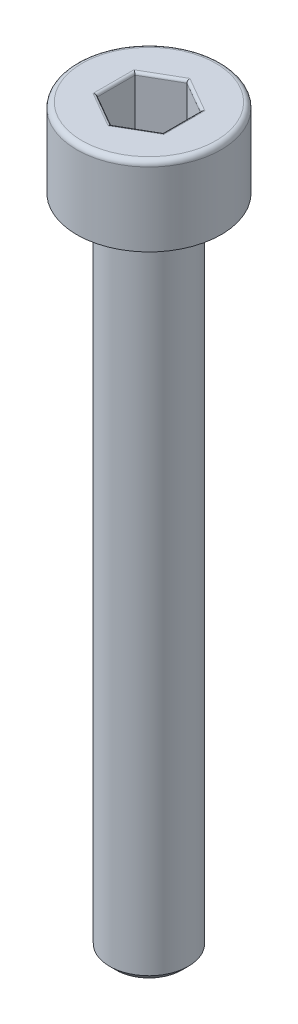
ISO-10303-21;
HEADER;
FILE_DESCRIPTION(('STEP AP214'),'2;1');
FILE_NAME('part.step','',(''),(''),'','','');
FILE_SCHEMA(('AUTOMOTIVE_DESIGN { 1 0 10303 214 1 1 1 1 }'));
ENDSEC;
DATA;
#1=APPLICATION_CONTEXT('core data for automotive mechanical design processes');
#2=APPLICATION_PROTOCOL_DEFINITION('international standard','automotive_design',2000,#1);
#3=PRODUCT_CONTEXT('',#1,'mechanical');
#4=PRODUCT('Part','Part','',(#3));
#5=PRODUCT_RELATED_PRODUCT_CATEGORY('part','',(#4));
#6=PRODUCT_DEFINITION_FORMATION('','',#4);
#7=PRODUCT_DEFINITION_CONTEXT('part definition',#1,'design');
#8=PRODUCT_DEFINITION('design','',#6,#7);
#9=PRODUCT_DEFINITION_SHAPE('','',#8);
#10=(LENGTH_UNIT() NAMED_UNIT(*) SI_UNIT(.MILLI.,.METRE.));
#11=(NAMED_UNIT(*) PLANE_ANGLE_UNIT() SI_UNIT($,.RADIAN.));
#12=(NAMED_UNIT(*) SI_UNIT($,.STERADIAN.) SOLID_ANGLE_UNIT());
#13=UNCERTAINTY_MEASURE_WITH_UNIT(LENGTH_MEASURE(1.E-05),#10,'distance_accuracy_value','');
#14=(GEOMETRIC_REPRESENTATION_CONTEXT(3) GLOBAL_UNCERTAINTY_ASSIGNED_CONTEXT((#13)) GLOBAL_UNIT_ASSIGNED_CONTEXT((#10,
#11,#12)) REPRESENTATION_CONTEXT('',''));
#15=CARTESIAN_POINT('',(0.,0.,0.));
#16=DIRECTION('',(0.,0.,1.));
#17=DIRECTION('',(1.,0.,0.));
#18=AXIS2_PLACEMENT_3D('',#15,#16,#17);
#19=CARTESIAN_POINT('',(0.,-28.,0.));
#20=DIRECTION('',(0.,-1.,0.));
#21=DIRECTION('',(0.,0.,-1.));
#22=AXIS2_PLACEMENT_3D('',#19,#20,#21);
#23=PLANE('',#22);
#24=CARTESIAN_POINT('',(0.,-28.,0.));
#25=DIRECTION('',(0.,-1.,0.));
#26=DIRECTION('',(0.,0.,-1.));
#27=AXIS2_PLACEMENT_3D('',#24,#25,#26);
#28=CIRCLE('',#27,1.25);
#29=CARTESIAN_POINT('',(0.,-28.,-1.25));
#30=VERTEX_POINT('',#29);
#31=EDGE_CURVE('E263',#30,#30,#28,.T.);
#32=ORIENTED_EDGE('',*,*,#31,.T.);
#33=EDGE_LOOP('',(#32));
#34=FACE_BOUND('',#33,.T.);
#35=ADVANCED_FACE('F35',(#34),#23,.T.);
#36=CARTESIAN_POINT('',(0.,0.,0.));
#37=DIRECTION('',(0.,1.,0.));
#38=DIRECTION('',(0.,0.,1.));
#39=AXIS2_PLACEMENT_3D('',#36,#37,#38);
#40=CYLINDRICAL_SURFACE('',#39,1.5);
#41=CARTESIAN_POINT('',(0.,-3.25,0.));
#42=DIRECTION('',(0.,-1.,0.));
#43=DIRECTION('',(0.,0.,-1.));
#44=AXIS2_PLACEMENT_3D('',#41,#42,#43);
#45=CIRCLE('',#44,1.5);
#46=CARTESIAN_POINT('',(0.,-3.25,-1.5));
#47=VERTEX_POINT('',#46);
#48=EDGE_CURVE('E260',#47,#47,#45,.T.);
#49=ORIENTED_EDGE('',*,*,#48,.T.);
#50=EDGE_LOOP('',(#49));
#51=FACE_BOUND('',#50,.T.);
#52=CARTESIAN_POINT('',(0.,-27.75,0.));
#53=DIRECTION('',(0.,-1.,0.));
#54=DIRECTION('',(0.,0.,-1.));
#55=AXIS2_PLACEMENT_3D('',#52,#53,#54);
#56=CIRCLE('',#55,1.5);
#57=CARTESIAN_POINT('',(0.,-27.75,-1.5));
#58=VERTEX_POINT('',#57);
#59=EDGE_CURVE('E257',#58,#58,#56,.F.);
#60=ORIENTED_EDGE('',*,*,#59,.T.);
#61=EDGE_LOOP('',(#60));
#62=FACE_BOUND('',#61,.T.);
#63=ADVANCED_FACE('F289',(#51,#62),#40,.T.);
#64=CARTESIAN_POINT('',(-1.5,-3.,0.));
#65=DIRECTION('',(0.,-1.,0.));
#66=DIRECTION('',(0.,0.,-1.));
#67=AXIS2_PLACEMENT_3D('',#64,#65,#66);
#68=PLANE('',#67);
#69=CARTESIAN_POINT('',(0.,-3.,0.));
#70=DIRECTION('',(0.,-1.,0.));
#71=DIRECTION('',(0.,0.,-1.));
#72=AXIS2_PLACEMENT_3D('',#69,#70,#71);
#73=CIRCLE('',#72,1.75);
#74=CARTESIAN_POINT('',(0.,-3.,-1.75));
#75=VERTEX_POINT('',#74);
#76=EDGE_CURVE('E254',#75,#75,#73,.F.);
#77=ORIENTED_EDGE('',*,*,#76,.T.);
#78=EDGE_LOOP('',(#77));
#79=FACE_BOUND('',#78,.T.);
#80=CARTESIAN_POINT('',(0.,-3.,0.));
#81=DIRECTION('',(0.,1.,0.));
#82=DIRECTION('',(0.,0.,1.));
#83=AXIS2_PLACEMENT_3D('',#80,#81,#82);
#84=CIRCLE('',#83,2.75);
#85=CARTESIAN_POINT('',(0.,-3.,2.75));
#86=VERTEX_POINT('',#85);
#87=EDGE_CURVE('E251',#86,#86,#84,.T.);
#88=ORIENTED_EDGE('',*,*,#87,.F.);
#89=EDGE_LOOP('',(#88));
#90=FACE_BOUND('',#89,.T.);
#91=ADVANCED_FACE('F295',(#79,#90),#68,.T.);
#92=CARTESIAN_POINT('',(0.,0.,0.));
#93=DIRECTION('',(0.,1.,0.));
#94=DIRECTION('',(0.,0.,1.));
#95=AXIS2_PLACEMENT_3D('',#92,#93,#94);
#96=CYLINDRICAL_SURFACE('',#95,2.75);
#97=CARTESIAN_POINT('',(0.,-0.2,0.));
#98=DIRECTION('',(0.,1.,0.));
#99=DIRECTION('',(0.,0.,1.));
#100=AXIS2_PLACEMENT_3D('',#97,#98,#99);
#101=CIRCLE('',#100,2.75);
#102=CARTESIAN_POINT('',(0.,-0.2,2.75));
#103=VERTEX_POINT('',#102);
#104=EDGE_CURVE('E161',#103,#103,#101,.F.);
#105=ORIENTED_EDGE('',*,*,#104,.T.);
#106=EDGE_LOOP('',(#105));
#107=FACE_BOUND('',#106,.T.);
#108=ORIENTED_EDGE('',*,*,#87,.T.);
#109=EDGE_LOOP('',(#108));
#110=FACE_BOUND('',#109,.T.);
#111=ADVANCED_FACE('F305',(#107,#110),#96,.T.);
#112=CARTESIAN_POINT('',(-2.75,0.,0.));
#113=DIRECTION('',(0.,1.,0.));
#114=DIRECTION('',(0.,0.,1.));
#115=AXIS2_PLACEMENT_3D('',#112,#113,#114);
#116=PLANE('',#115);
#117=DIRECTION('',(0.,0.,1.));
#118=VECTOR('',#117,1.);
#119=CARTESIAN_POINT('',(-1.35,0.,-0.721687836487033));
#120=LINE('',#119,#118);
#121=CARTESIAN_POINT('',(-1.35,0.,0.779422863405995));
#122=VERTEX_POINT('',#121);
#123=CARTESIAN_POINT('',(-1.35,0.,-0.779422863405995));
#124=VERTEX_POINT('',#123);
#125=EDGE_CURVE('E177',#122,#124,#120,.F.);
#126=ORIENTED_EDGE('',*,*,#125,.T.);
#127=DIRECTION('',(-0.866025403784439,0.,0.5));
#128=VECTOR('',#127,1.);
#129=CARTESIAN_POINT('',(-0.0500000000000002,0.,-1.52997821335251));
#130=LINE('',#129,#128);
#131=CARTESIAN_POINT('',(0.,0.,-1.55884572681199));
#132=VERTEX_POINT('',#131);
#133=EDGE_CURVE('E136',#124,#132,#130,.F.);
#134=ORIENTED_EDGE('',*,*,#133,.T.);
#135=DIRECTION('',(-0.866025403784439,0.,-0.5));
#136=VECTOR('',#135,1.);
#137=CARTESIAN_POINT('',(1.3,0.,-0.808290376865477));
#138=LINE('',#137,#136);
#139=CARTESIAN_POINT('',(1.35,0.,-0.779422863405995));
#140=VERTEX_POINT('',#139);
#141=EDGE_CURVE('E163',#132,#140,#138,.F.);
#142=ORIENTED_EDGE('',*,*,#141,.T.);
#143=DIRECTION('',(0.,0.,-1.));
#144=VECTOR('',#143,1.);
#145=CARTESIAN_POINT('',(1.35,0.,0.721687836487034));
#146=LINE('',#145,#144);
#147=CARTESIAN_POINT('',(1.35,0.,0.779422863405996));
#148=VERTEX_POINT('',#147);
#149=EDGE_CURVE('E171',#140,#148,#146,.F.);
#150=ORIENTED_EDGE('',*,*,#149,.T.);
#151=DIRECTION('',(0.866025403784439,0.,-0.5));
#152=VECTOR('',#151,1.);
#153=CARTESIAN_POINT('',(0.05,0.,1.52997821335251));
#154=LINE('',#153,#152);
#155=CARTESIAN_POINT('',(0.,0.,1.55884572681199));
#156=VERTEX_POINT('',#155);
#157=EDGE_CURVE('E173',#148,#156,#154,.F.);
#158=ORIENTED_EDGE('',*,*,#157,.T.);
#159=DIRECTION('',(0.866025403784438,0.,0.5));
#160=VECTOR('',#159,1.);
#161=CARTESIAN_POINT('',(-1.3,0.,0.808290376865476));
#162=LINE('',#161,#160);
#163=EDGE_CURVE('E175',#156,#122,#162,.F.);
#164=ORIENTED_EDGE('',*,*,#163,.T.);
#165=EDGE_LOOP('',(#126,#134,#142,#150,#158,#164));
#166=FACE_BOUND('',#165,.T.);
#167=CARTESIAN_POINT('',(0.,0.,0.));
#168=DIRECTION('',(0.,1.,0.));
#169=DIRECTION('',(0.,0.,1.));
#170=AXIS2_PLACEMENT_3D('',#167,#168,#169);
#171=CIRCLE('',#170,2.55);
#172=CARTESIAN_POINT('',(0.,0.,2.55));
#173=VERTEX_POINT('',#172);
#174=EDGE_CURVE('E166',#173,#173,#171,.T.);
#175=ORIENTED_EDGE('',*,*,#174,.T.);
#176=EDGE_LOOP('',(#175));
#177=FACE_BOUND('',#176,.T.);
#178=ADVANCED_FACE('F268',(#166,#177),#116,.T.);
#179=CARTESIAN_POINT('',(0.,-3.,0.));
#180=DIRECTION('',(0.,1.,0.));
#181=DIRECTION('',(0.,0.,1.));
#182=AXIS2_PLACEMENT_3D('',#179,#180,#181);
#183=CONICAL_SURFACE('',#182,1.75,0.785398163397452);
#184=ORIENTED_EDGE('',*,*,#48,.F.);
#185=EDGE_LOOP('',(#184));
#186=FACE_BOUND('',#185,.T.);
#187=ORIENTED_EDGE('',*,*,#76,.F.);
#188=EDGE_LOOP('',(#187));
#189=FACE_BOUND('',#188,.T.);
#190=ADVANCED_FACE('F283',(#186,#189),#183,.T.);
#191=CARTESIAN_POINT('',(0.,-27.75,0.));
#192=DIRECTION('',(0.,1.,0.));
#193=DIRECTION('',(0.,0.,1.));
#194=AXIS2_PLACEMENT_3D('',#191,#192,#193);
#195=CONICAL_SURFACE('',#194,1.5,0.785398163397451);
#196=ORIENTED_EDGE('',*,*,#31,.F.);
#197=EDGE_LOOP('',(#196));
#198=FACE_BOUND('',#197,.T.);
#199=ORIENTED_EDGE('',*,*,#59,.F.);
#200=EDGE_LOOP('',(#199));
#201=FACE_BOUND('',#200,.T.);
#202=ADVANCED_FACE('F273',(#198,#201),#195,.T.);
#203=CARTESIAN_POINT('',(0.,-0.2,0.));
#204=DIRECTION('',(0.,1.,0.));
#205=DIRECTION('',(0.,0.,1.));
#206=AXIS2_PLACEMENT_3D('',#203,#204,#205);
#207=TOROIDAL_SURFACE('',#206,2.55,0.2);
#208=ORIENTED_EDGE('',*,*,#104,.F.);
#209=EDGE_LOOP('',(#208));
#210=FACE_BOUND('',#209,.T.);
#211=ORIENTED_EDGE('',*,*,#174,.F.);
#212=EDGE_LOOP('',(#211));
#213=FACE_BOUND('',#212,.T.);
#214=ADVANCED_FACE('F270',(#210,#213),#207,.T.);
#215=CARTESIAN_POINT('',(1.25,-2.,-0.721687836487033));
#216=DIRECTION('',(0.5,0.,-0.866025403784439));
#217=DIRECTION('',(-0.866025403784439,0.,-0.5));
#218=AXIS2_PLACEMENT_3D('',#215,#216,#217);
#219=PLANE('',#218);
#220=DIRECTION('',(0.,1.,0.));
#221=VECTOR('',#220,1.);
#222=CARTESIAN_POINT('',(1.25,-2.,-0.721687836487033));
#223=LINE('',#222,#221);
#224=CARTESIAN_POINT('',(1.25,-1.9,-0.721687836487033));
#225=VERTEX_POINT('',#224);
#226=CARTESIAN_POINT('',(1.25,-0.1,-0.721687836487033));
#227=VERTEX_POINT('',#226);
#228=EDGE_CURVE('E245',#225,#227,#223,.T.);
#229=ORIENTED_EDGE('',*,*,#228,.T.);
#230=DIRECTION('',(-0.866025403784439,0.,-0.5));
#231=VECTOR('',#230,1.);
#232=CARTESIAN_POINT('',(0.,-0.1,-1.44337567297406));
#233=LINE('',#232,#231);
#234=CARTESIAN_POINT('',(0.,-0.1,-1.44337567297406));
#235=VERTEX_POINT('',#234);
#236=EDGE_CURVE('E197',#227,#235,#233,.T.);
#237=ORIENTED_EDGE('',*,*,#236,.T.);
#238=DIRECTION('',(0.,1.,0.));
#239=VECTOR('',#238,1.);
#240=CARTESIAN_POINT('',(0.,-2.,-1.44337567297406));
#241=LINE('',#240,#239);
#242=CARTESIAN_POINT('',(0.,-1.9,-1.44337567297406));
#243=VERTEX_POINT('',#242);
#244=EDGE_CURVE('E147',#243,#235,#241,.T.);
#245=ORIENTED_EDGE('',*,*,#244,.F.);
#246=DIRECTION('',(-0.866025403784439,0.,-0.5));
#247=VECTOR('',#246,1.);
#248=CARTESIAN_POINT('',(1.25,-1.9,-0.721687836487033));
#249=LINE('',#248,#247);
#250=EDGE_CURVE('E195',#243,#225,#249,.F.);
#251=ORIENTED_EDGE('',*,*,#250,.T.);
#252=EDGE_LOOP('',(#229,#237,#245,#251));
#253=FACE_BOUND('',#252,.T.);
#254=ADVANCED_FACE('F272',(#253),#219,.F.);
#255=CARTESIAN_POINT('',(1.25,-2.,0.721687836487034));
#256=DIRECTION('',(1.,0.,0.));
#257=DIRECTION('',(0.,0.,-1.));
#258=AXIS2_PLACEMENT_3D('',#255,#256,#257);
#259=PLANE('',#258);
#260=DIRECTION('',(0.,1.,0.));
#261=VECTOR('',#260,1.);
#262=CARTESIAN_POINT('',(1.25,-2.,0.721687836487034));
#263=LINE('',#262,#261);
#264=CARTESIAN_POINT('',(1.25,-1.9,0.721687836487034));
#265=VERTEX_POINT('',#264);
#266=CARTESIAN_POINT('',(1.25,-0.1,0.721687836487034));
#267=VERTEX_POINT('',#266);
#268=EDGE_CURVE('E242',#265,#267,#263,.T.);
#269=ORIENTED_EDGE('',*,*,#268,.T.);
#270=DIRECTION('',(0.,0.,-1.));
#271=VECTOR('',#270,1.);
#272=CARTESIAN_POINT('',(1.25,-0.1,-0.721687836487033));
#273=LINE('',#272,#271);
#274=EDGE_CURVE('E193',#267,#227,#273,.T.);
#275=ORIENTED_EDGE('',*,*,#274,.T.);
#276=ORIENTED_EDGE('',*,*,#228,.F.);
#277=DIRECTION('',(0.,0.,-1.));
#278=VECTOR('',#277,1.);
#279=CARTESIAN_POINT('',(1.25,-1.9,0.721687836487034));
#280=LINE('',#279,#278);
#281=EDGE_CURVE('E190',#225,#265,#280,.F.);
#282=ORIENTED_EDGE('',*,*,#281,.T.);
#283=EDGE_LOOP('',(#269,#275,#276,#282));
#284=FACE_BOUND('',#283,.T.);
#285=ADVANCED_FACE('F280',(#284),#259,.F.);
#286=CARTESIAN_POINT('',(0.,-2.,1.44337567297407));
#287=DIRECTION('',(0.5,0.,0.866025403784439));
#288=DIRECTION('',(0.866025403784439,0.,-0.5));
#289=AXIS2_PLACEMENT_3D('',#286,#287,#288);
#290=PLANE('',#289);
#291=DIRECTION('',(0.,1.,0.));
#292=VECTOR('',#291,1.);
#293=CARTESIAN_POINT('',(0.,-2.,1.44337567297407));
#294=LINE('',#293,#292);
#295=CARTESIAN_POINT('',(0.,-1.9,1.44337567297407));
#296=VERTEX_POINT('',#295);
#297=CARTESIAN_POINT('',(0.,-0.1,1.44337567297407));
#298=VERTEX_POINT('',#297);
#299=EDGE_CURVE('E239',#296,#298,#294,.T.);
#300=ORIENTED_EDGE('',*,*,#299,.T.);
#301=DIRECTION('',(0.866025403784439,0.,-0.5));
#302=VECTOR('',#301,1.);
#303=CARTESIAN_POINT('',(1.25,-0.1,0.721687836487034));
#304=LINE('',#303,#302);
#305=EDGE_CURVE('E188',#298,#267,#304,.T.);
#306=ORIENTED_EDGE('',*,*,#305,.T.);
#307=ORIENTED_EDGE('',*,*,#268,.F.);
#308=DIRECTION('',(0.866025403784439,0.,-0.5));
#309=VECTOR('',#308,1.);
#310=CARTESIAN_POINT('',(0.,-1.9,1.44337567297407));
#311=LINE('',#310,#309);
#312=EDGE_CURVE('E186',#265,#296,#311,.F.);
#313=ORIENTED_EDGE('',*,*,#312,.T.);
#314=EDGE_LOOP('',(#300,#306,#307,#313));
#315=FACE_BOUND('',#314,.T.);
#316=ADVANCED_FACE('F329',(#315),#290,.F.);
#317=CARTESIAN_POINT('',(-1.25,-2.,0.721687836487033));
#318=DIRECTION('',(-0.5,0.,0.866025403784439));
#319=DIRECTION('',(0.866025403784438,0.,0.5));
#320=AXIS2_PLACEMENT_3D('',#317,#318,#319);
#321=PLANE('',#320);
#322=DIRECTION('',(0.,1.,0.));
#323=VECTOR('',#322,1.);
#324=CARTESIAN_POINT('',(-1.25,-2.,0.721687836487033));
#325=LINE('',#324,#323);
#326=CARTESIAN_POINT('',(-1.25,-1.9,0.721687836487033));
#327=VERTEX_POINT('',#326);
#328=CARTESIAN_POINT('',(-1.25,-0.1,0.721687836487033));
#329=VERTEX_POINT('',#328);
#330=EDGE_CURVE('E130',#327,#329,#325,.T.);
#331=ORIENTED_EDGE('',*,*,#330,.T.);
#332=DIRECTION('',(0.866025403784438,0.,0.5));
#333=VECTOR('',#332,1.);
#334=CARTESIAN_POINT('',(0.,-0.1,1.44337567297407));
#335=LINE('',#334,#333);
#336=EDGE_CURVE('E184',#329,#298,#335,.T.);
#337=ORIENTED_EDGE('',*,*,#336,.T.);
#338=ORIENTED_EDGE('',*,*,#299,.F.);
#339=DIRECTION('',(0.866025403784438,0.,0.5));
#340=VECTOR('',#339,1.);
#341=CARTESIAN_POINT('',(-1.25,-1.9,0.721687836487033));
#342=LINE('',#341,#340);
#343=EDGE_CURVE('E182',#296,#327,#342,.F.);
#344=ORIENTED_EDGE('',*,*,#343,.T.);
#345=EDGE_LOOP('',(#331,#337,#338,#344));
#346=FACE_BOUND('',#345,.T.);
#347=ADVANCED_FACE('F236',(#346),#321,.F.);
#348=CARTESIAN_POINT('',(-1.25,-2.,-0.721687836487033));
#349=DIRECTION('',(-1.,0.,0.));
#350=DIRECTION('',(0.,0.,1.));
#351=AXIS2_PLACEMENT_3D('',#348,#349,#350);
#352=PLANE('',#351);
#353=DIRECTION('',(0.,1.,0.));
#354=VECTOR('',#353,1.);
#355=CARTESIAN_POINT('',(-1.25,-2.,-0.721687836487033));
#356=LINE('',#355,#354);
#357=CARTESIAN_POINT('',(-1.25,-1.9,-0.721687836487033));
#358=VERTEX_POINT('',#357);
#359=CARTESIAN_POINT('',(-1.25,-0.1,-0.721687836487033));
#360=VERTEX_POINT('',#359);
#361=EDGE_CURVE('E128',#358,#360,#356,.T.);
#362=ORIENTED_EDGE('',*,*,#361,.T.);
#363=DIRECTION('',(0.,0.,1.));
#364=VECTOR('',#363,1.);
#365=CARTESIAN_POINT('',(-1.25,-0.1,0.721687836487033));
#366=LINE('',#365,#364);
#367=EDGE_CURVE('E135',#360,#329,#366,.T.);
#368=ORIENTED_EDGE('',*,*,#367,.T.);
#369=ORIENTED_EDGE('',*,*,#330,.F.);
#370=DIRECTION('',(0.,0.,1.));
#371=VECTOR('',#370,1.);
#372=CARTESIAN_POINT('',(-1.25,-1.9,-0.721687836487033));
#373=LINE('',#372,#371);
#374=EDGE_CURVE('E125',#327,#358,#373,.F.);
#375=ORIENTED_EDGE('',*,*,#374,.T.);
#376=EDGE_LOOP('',(#362,#368,#369,#375));
#377=FACE_BOUND('',#376,.T.);
#378=ADVANCED_FACE('F127',(#377),#352,.F.);
#379=CARTESIAN_POINT('',(0.,-2.,-1.44337567297406));
#380=DIRECTION('',(-0.5,0.,-0.866025403784439));
#381=DIRECTION('',(-0.866025403784439,0.,0.5));
#382=AXIS2_PLACEMENT_3D('',#379,#380,#381);
#383=PLANE('',#382);
#384=ORIENTED_EDGE('',*,*,#244,.T.);
#385=DIRECTION('',(-0.866025403784439,0.,0.5));
#386=VECTOR('',#385,1.);
#387=CARTESIAN_POINT('',(-1.25,-0.1,-0.721687836487032));
#388=LINE('',#387,#386);
#389=EDGE_CURVE('E146',#235,#360,#388,.T.);
#390=ORIENTED_EDGE('',*,*,#389,.T.);
#391=ORIENTED_EDGE('',*,*,#361,.F.);
#392=DIRECTION('',(-0.866025403784439,0.,0.5));
#393=VECTOR('',#392,1.);
#394=CARTESIAN_POINT('',(0.,-1.9,-1.44337567297406));
#395=LINE('',#394,#393);
#396=EDGE_CURVE('E143',#358,#243,#395,.F.);
#397=ORIENTED_EDGE('',*,*,#396,.T.);
#398=EDGE_LOOP('',(#384,#390,#391,#397));
#399=FACE_BOUND('',#398,.T.);
#400=ADVANCED_FACE('F141',(#399),#383,.F.);
#401=CARTESIAN_POINT('',(1.25,-2.,-0.721687836487033));
#402=DIRECTION('',(0.,-1.,0.));
#403=DIRECTION('',(0.,0.,-1.));
#404=AXIS2_PLACEMENT_3D('',#401,#402,#403);
#405=PLANE('',#404);
#406=DIRECTION('',(0.866025403784439,0.,-0.5));
#407=VECTOR('',#406,1.);
#408=CARTESIAN_POINT('',(1.2,-2.,0.63508529610859));
#409=LINE('',#408,#407);
#410=CARTESIAN_POINT('',(0.,-2.,1.32790561913614));
#411=VERTEX_POINT('',#410);
#412=CARTESIAN_POINT('',(1.15,-2.,0.663952809568071));
#413=VERTEX_POINT('',#412);
#414=EDGE_CURVE('E44',#411,#413,#409,.T.);
#415=ORIENTED_EDGE('',*,*,#414,.T.);
#416=DIRECTION('',(0.,0.,-1.));
#417=VECTOR('',#416,1.);
#418=CARTESIAN_POINT('',(1.15,-2.,-0.721687836487033));
#419=LINE('',#418,#417);
#420=CARTESIAN_POINT('',(1.15,-2.,-0.66395280956807));
#421=VERTEX_POINT('',#420);
#422=EDGE_CURVE('E11',#413,#421,#419,.T.);
#423=ORIENTED_EDGE('',*,*,#422,.T.);
#424=DIRECTION('',(-0.866025403784439,0.,-0.5));
#425=VECTOR('',#424,1.);
#426=CARTESIAN_POINT('',(-0.0500000000000001,-2.,-1.35677313259562));
#427=LINE('',#426,#425);
#428=CARTESIAN_POINT('',(0.,-2.,-1.32790561913614));
#429=VERTEX_POINT('',#428);
#430=EDGE_CURVE('E199',#421,#429,#427,.T.);
#431=ORIENTED_EDGE('',*,*,#430,.T.);
#432=DIRECTION('',(-0.866025403784439,0.,0.5));
#433=VECTOR('',#432,1.);
#434=CARTESIAN_POINT('',(-1.2,-2.,-0.635085296108588));
#435=LINE('',#434,#433);
#436=CARTESIAN_POINT('',(-1.15,-2.,-0.66395280956807));
#437=VERTEX_POINT('',#436);
#438=EDGE_CURVE('E201',#429,#437,#435,.T.);
#439=ORIENTED_EDGE('',*,*,#438,.T.);
#440=DIRECTION('',(0.,0.,1.));
#441=VECTOR('',#440,1.);
#442=CARTESIAN_POINT('',(-1.15,-2.,0.721687836487033));
#443=LINE('',#442,#441);
#444=CARTESIAN_POINT('',(-1.15,-2.,0.66395280956807));
#445=VERTEX_POINT('',#444);
#446=EDGE_CURVE('E152',#437,#445,#443,.T.);
#447=ORIENTED_EDGE('',*,*,#446,.T.);
#448=DIRECTION('',(0.866025403784438,0.,0.5));
#449=VECTOR('',#448,1.);
#450=CARTESIAN_POINT('',(0.0499999999999999,-2.,1.35677313259562));
#451=LINE('',#450,#449);
#452=EDGE_CURVE('E55',#445,#411,#451,.T.);
#453=ORIENTED_EDGE('',*,*,#452,.T.);
#454=EDGE_LOOP('',(#415,#423,#431,#439,#447,#453));
#455=FACE_BOUND('',#454,.T.);
#456=ADVANCED_FACE('F324',(#455),#405,.F.);
#457=CARTESIAN_POINT('',(0.05,-0.1,1.52997821335251));
#458=DIRECTION('',(-0.866025403784439,0.,0.5));
#459=DIRECTION('',(0.5,0.,0.866025403784439));
#460=AXIS2_PLACEMENT_3D('',#457,#458,#459);
#461=CYLINDRICAL_SURFACE('',#460,0.1);
#462=CARTESIAN_POINT('',(0.,-0.1,1.55884572681199));
#463=DIRECTION('',(-1.,0.,0.));
#464=DIRECTION('',(0.,0.,-1.));
#465=AXIS2_PLACEMENT_3D('',#462,#463,#464);
#466=ELLIPSE('',#465,0.115470053837925,0.1);
#467=EDGE_CURVE('E216',#156,#298,#466,.T.);
#468=ORIENTED_EDGE('',*,*,#467,.F.);
#469=ORIENTED_EDGE('',*,*,#157,.F.);
#470=CARTESIAN_POINT('',(1.35,-0.1,0.779422863405997));
#471=DIRECTION('',(-0.5,0.,0.866025403784438));
#472=DIRECTION('',(-0.866025403784438,0.,-0.5));
#473=AXIS2_PLACEMENT_3D('',#470,#471,#472);
#474=ELLIPSE('',#473,0.115470053837925,0.1);
#475=EDGE_CURVE('E219',#267,#148,#474,.F.);
#476=ORIENTED_EDGE('',*,*,#475,.F.);
#477=ORIENTED_EDGE('',*,*,#305,.F.);
#478=EDGE_LOOP('',(#468,#469,#476,#477));
#479=FACE_BOUND('',#478,.T.);
#480=ADVANCED_FACE('F336',(#479),#461,.T.);
#481=CARTESIAN_POINT('',(1.35,-0.1,0.721687836487034));
#482=DIRECTION('',(0.,0.,1.));
#483=DIRECTION('',(1.,0.,0.));
#484=AXIS2_PLACEMENT_3D('',#481,#482,#483);
#485=CYLINDRICAL_SURFACE('',#484,0.1);
#486=ORIENTED_EDGE('',*,*,#475,.T.);
#487=ORIENTED_EDGE('',*,*,#149,.F.);
#488=CARTESIAN_POINT('',(1.35,-0.1,-0.779422863405995));
#489=DIRECTION('',(0.5,0.,0.866025403784439));
#490=DIRECTION('',(-0.866025403784439,0.,0.5));
#491=AXIS2_PLACEMENT_3D('',#488,#489,#490);
#492=ELLIPSE('',#491,0.115470053837925,0.1);
#493=EDGE_CURVE('E213',#227,#140,#492,.F.);
#494=ORIENTED_EDGE('',*,*,#493,.F.);
#495=ORIENTED_EDGE('',*,*,#274,.F.);
#496=EDGE_LOOP('',(#486,#487,#494,#495));
#497=FACE_BOUND('',#496,.T.);
#498=ADVANCED_FACE('F340',(#497),#485,.T.);
#499=CARTESIAN_POINT('',(-1.3,-0.1,0.808290376865476));
#500=DIRECTION('',(-0.866025403784438,0.,-0.5));
#501=DIRECTION('',(-0.5,0.,0.866025403784439));
#502=AXIS2_PLACEMENT_3D('',#499,#500,#501);
#503=CYLINDRICAL_SURFACE('',#502,0.1);
#504=ORIENTED_EDGE('',*,*,#467,.T.);
#505=ORIENTED_EDGE('',*,*,#336,.F.);
#506=CARTESIAN_POINT('',(-1.35,-0.1,0.779422863405995));
#507=DIRECTION('',(-0.5,0.,-0.866025403784439));
#508=DIRECTION('',(0.866025403784439,0.,-0.5));
#509=AXIS2_PLACEMENT_3D('',#506,#507,#508);
#510=ELLIPSE('',#509,0.115470053837925,0.1);
#511=EDGE_CURVE('E210',#122,#329,#510,.T.);
#512=ORIENTED_EDGE('',*,*,#511,.F.);
#513=ORIENTED_EDGE('',*,*,#163,.F.);
#514=EDGE_LOOP('',(#504,#505,#512,#513));
#515=FACE_BOUND('',#514,.T.);
#516=ADVANCED_FACE('F346',(#515),#503,.T.);
#517=CARTESIAN_POINT('',(1.3,-0.1,-0.808290376865477));
#518=DIRECTION('',(0.866025403784439,0.,0.5));
#519=DIRECTION('',(0.5,0.,-0.866025403784439));
#520=AXIS2_PLACEMENT_3D('',#517,#518,#519);
#521=CYLINDRICAL_SURFACE('',#520,0.1);
#522=ORIENTED_EDGE('',*,*,#493,.T.);
#523=ORIENTED_EDGE('',*,*,#141,.F.);
#524=CARTESIAN_POINT('',(0.,-0.1,-1.55884572681199));
#525=DIRECTION('',(1.,0.,0.));
#526=DIRECTION('',(0.,0.,-1.));
#527=AXIS2_PLACEMENT_3D('',#524,#525,#526);
#528=ELLIPSE('',#527,0.115470053837925,0.1);
#529=EDGE_CURVE('E208',#235,#132,#528,.F.);
#530=ORIENTED_EDGE('',*,*,#529,.F.);
#531=ORIENTED_EDGE('',*,*,#236,.F.);
#532=EDGE_LOOP('',(#522,#523,#530,#531));
#533=FACE_BOUND('',#532,.T.);
#534=ADVANCED_FACE('F376',(#533),#521,.T.);
#535=CARTESIAN_POINT('',(-1.35,-0.1,-0.721687836487033));
#536=DIRECTION('',(0.,0.,-1.));
#537=DIRECTION('',(-1.,0.,0.));
#538=AXIS2_PLACEMENT_3D('',#535,#536,#537);
#539=CYLINDRICAL_SURFACE('',#538,0.1);
#540=ORIENTED_EDGE('',*,*,#511,.T.);
#541=ORIENTED_EDGE('',*,*,#367,.F.);
#542=CARTESIAN_POINT('',(-1.35,-0.1,-0.779422863405995));
#543=DIRECTION('',(0.5,0.,-0.866025403784439));
#544=DIRECTION('',(0.866025403784439,0.,0.5));
#545=AXIS2_PLACEMENT_3D('',#542,#543,#544);
#546=ELLIPSE('',#545,0.115470053837925,0.1);
#547=EDGE_CURVE('E206',#124,#360,#546,.T.);
#548=ORIENTED_EDGE('',*,*,#547,.F.);
#549=ORIENTED_EDGE('',*,*,#125,.F.);
#550=EDGE_LOOP('',(#540,#541,#548,#549));
#551=FACE_BOUND('',#550,.T.);
#552=ADVANCED_FACE('F371',(#551),#539,.T.);
#553=CARTESIAN_POINT('',(-0.05,-0.1,-1.52997821335251));
#554=DIRECTION('',(0.866025403784439,0.,-0.5));
#555=DIRECTION('',(-0.5,0.,-0.866025403784439));
#556=AXIS2_PLACEMENT_3D('',#553,#554,#555);
#557=CYLINDRICAL_SURFACE('',#556,0.1);
#558=ORIENTED_EDGE('',*,*,#529,.T.);
#559=ORIENTED_EDGE('',*,*,#133,.F.);
#560=ORIENTED_EDGE('',*,*,#547,.T.);
#561=ORIENTED_EDGE('',*,*,#389,.F.);
#562=EDGE_LOOP('',(#558,#559,#560,#561));
#563=FACE_BOUND('',#562,.T.);
#564=ADVANCED_FACE('F367',(#563),#557,.T.);
#565=CARTESIAN_POINT('',(-1.15,-1.9,-0.721687836487033));
#566=DIRECTION('',(0.,0.,-1.));
#567=DIRECTION('',(-1.,0.,0.));
#568=AXIS2_PLACEMENT_3D('',#565,#566,#567);
#569=CYLINDRICAL_SURFACE('',#568,0.1);
#570=CARTESIAN_POINT('',(-1.15,-1.9,-0.663952809568069));
#571=DIRECTION('',(0.5,0.,-0.866025403784439));
#572=DIRECTION('',(-0.866025403784439,0.,-0.5));
#573=AXIS2_PLACEMENT_3D('',#570,#571,#572);
#574=ELLIPSE('',#573,0.115470053837925,0.1);
#575=EDGE_CURVE('E151',#358,#437,#574,.F.);
#576=ORIENTED_EDGE('',*,*,#575,.F.);
#577=ORIENTED_EDGE('',*,*,#374,.F.);
#578=CARTESIAN_POINT('',(-1.15,-1.9,0.66395280956807));
#579=DIRECTION('',(-0.5,0.,-0.866025403784439));
#580=DIRECTION('',(-0.866025403784439,0.,0.5));
#581=AXIS2_PLACEMENT_3D('',#578,#579,#580);
#582=ELLIPSE('',#581,0.115470053837925,0.1);
#583=EDGE_CURVE('E39',#445,#327,#582,.T.);
#584=ORIENTED_EDGE('',*,*,#583,.F.);
#585=ORIENTED_EDGE('',*,*,#446,.F.);
#586=EDGE_LOOP('',(#576,#577,#584,#585));
#587=FACE_BOUND('',#586,.T.);
#588=ADVANCED_FACE('F37',(#587),#569,.F.);
#589=CARTESIAN_POINT('',(0.0499999999999988,-1.9,1.35677313259562));
#590=DIRECTION('',(-0.866025403784438,0.,-0.5));
#591=DIRECTION('',(-0.5,0.,0.866025403784439));
#592=AXIS2_PLACEMENT_3D('',#589,#590,#591);
#593=CYLINDRICAL_SURFACE('',#592,0.1);
#594=ORIENTED_EDGE('',*,*,#583,.T.);
#595=ORIENTED_EDGE('',*,*,#343,.F.);
#596=CARTESIAN_POINT('',(0.,-1.9,1.32790561913614));
#597=DIRECTION('',(-1.,0.,0.));
#598=DIRECTION('',(0.,0.,1.));
#599=AXIS2_PLACEMENT_3D('',#596,#597,#598);
#600=ELLIPSE('',#599,0.115470053837925,0.1);
#601=EDGE_CURVE('E155',#411,#296,#600,.T.);
#602=ORIENTED_EDGE('',*,*,#601,.F.);
#603=ORIENTED_EDGE('',*,*,#452,.F.);
#604=EDGE_LOOP('',(#594,#595,#602,#603));
#605=FACE_BOUND('',#604,.T.);
#606=ADVANCED_FACE('F233',(#605),#593,.F.);
#607=CARTESIAN_POINT('',(0.675,-1.9,-1.71761705083914));
#608=DIRECTION('',(0.866025403784439,0.,-0.5));
#609=DIRECTION('',(-0.5,0.,-0.866025403784439));
#610=AXIS2_PLACEMENT_3D('',#607,#608,#609);
#611=CYLINDRICAL_SURFACE('',#610,0.1);
#612=ORIENTED_EDGE('',*,*,#575,.T.);
#613=ORIENTED_EDGE('',*,*,#438,.F.);
#614=CARTESIAN_POINT('',(0.,-1.9,-1.32790561913614));
#615=DIRECTION('',(1.,0.,0.));
#616=DIRECTION('',(0.,0.,-1.));
#617=AXIS2_PLACEMENT_3D('',#614,#615,#616);
#618=ELLIPSE('',#617,0.115470053837925,0.1);
#619=EDGE_CURVE('E159',#243,#429,#618,.F.);
#620=ORIENTED_EDGE('',*,*,#619,.F.);
#621=ORIENTED_EDGE('',*,*,#396,.F.);
#622=EDGE_LOOP('',(#612,#613,#620,#621));
#623=FACE_BOUND('',#622,.T.);
#624=ADVANCED_FACE('F157',(#623),#611,.F.);
#625=CARTESIAN_POINT('',(1.825,-1.9,0.274241377865074));
#626=DIRECTION('',(-0.866025403784439,0.,0.5));
#627=DIRECTION('',(0.5,0.,0.866025403784439));
#628=AXIS2_PLACEMENT_3D('',#625,#626,#627);
#629=CYLINDRICAL_SURFACE('',#628,0.1);
#630=ORIENTED_EDGE('',*,*,#601,.T.);
#631=ORIENTED_EDGE('',*,*,#312,.F.);
#632=CARTESIAN_POINT('',(1.15,-1.9,0.663952809568072));
#633=DIRECTION('',(-0.5,0.,0.866025403784438));
#634=DIRECTION('',(0.866025403784438,0.,0.5));
#635=AXIS2_PLACEMENT_3D('',#632,#633,#634);
#636=ELLIPSE('',#635,0.115470053837925,0.1);
#637=EDGE_CURVE('E224',#413,#265,#636,.T.);
#638=ORIENTED_EDGE('',*,*,#637,.F.);
#639=ORIENTED_EDGE('',*,*,#414,.F.);
#640=EDGE_LOOP('',(#630,#631,#638,#639));
#641=FACE_BOUND('',#640,.T.);
#642=ADVANCED_FACE('F230',(#641),#629,.F.);
#643=CARTESIAN_POINT('',(1.2,-1.9,-0.635085296108589));
#644=DIRECTION('',(0.866025403784439,0.,0.5));
#645=DIRECTION('',(0.5,0.,-0.866025403784439));
#646=AXIS2_PLACEMENT_3D('',#643,#644,#645);
#647=CYLINDRICAL_SURFACE('',#646,0.1);
#648=ORIENTED_EDGE('',*,*,#619,.T.);
#649=ORIENTED_EDGE('',*,*,#430,.F.);
#650=CARTESIAN_POINT('',(1.15,-1.9,-0.66395280956807));
#651=DIRECTION('',(0.5,0.,0.866025403784439));
#652=DIRECTION('',(-0.866025403784439,0.,0.5));
#653=AXIS2_PLACEMENT_3D('',#650,#651,#652);
#654=ELLIPSE('',#653,0.115470053837925,0.1);
#655=EDGE_CURVE('E222',#225,#421,#654,.F.);
#656=ORIENTED_EDGE('',*,*,#655,.F.);
#657=ORIENTED_EDGE('',*,*,#250,.F.);
#658=EDGE_LOOP('',(#648,#649,#656,#657));
#659=FACE_BOUND('',#658,.T.);
#660=ADVANCED_FACE('F355',(#659),#647,.F.);
#661=CARTESIAN_POINT('',(1.15,-1.9,-0.721687836487033));
#662=DIRECTION('',(0.,0.,1.));
#663=DIRECTION('',(1.,0.,0.));
#664=AXIS2_PLACEMENT_3D('',#661,#662,#663);
#665=CYLINDRICAL_SURFACE('',#664,0.1);
#666=ORIENTED_EDGE('',*,*,#637,.T.);
#667=ORIENTED_EDGE('',*,*,#281,.F.);
#668=ORIENTED_EDGE('',*,*,#655,.T.);
#669=ORIENTED_EDGE('',*,*,#422,.F.);
#670=EDGE_LOOP('',(#666,#667,#668,#669));
#671=FACE_BOUND('',#670,.T.);
#672=ADVANCED_FACE('F352',(#671),#665,.F.);
#673=CLOSED_SHELL('',(#35,#63,#91,#111,#178,#190,#202,#214,#254,#285,#316,#347,#378,#400,#456,
#480,#498,#516,#534,#552,#564,#588,#606,#624,#642,#660,#672));
#674=MANIFOLD_SOLID_BREP('B2',#673);
#675=ADVANCED_BREP_SHAPE_REPRESENTATION('',(#18,#674),#14);
#676=SHAPE_DEFINITION_REPRESENTATION(#9,#675);
ENDSEC;
END-ISO-10303-21;
